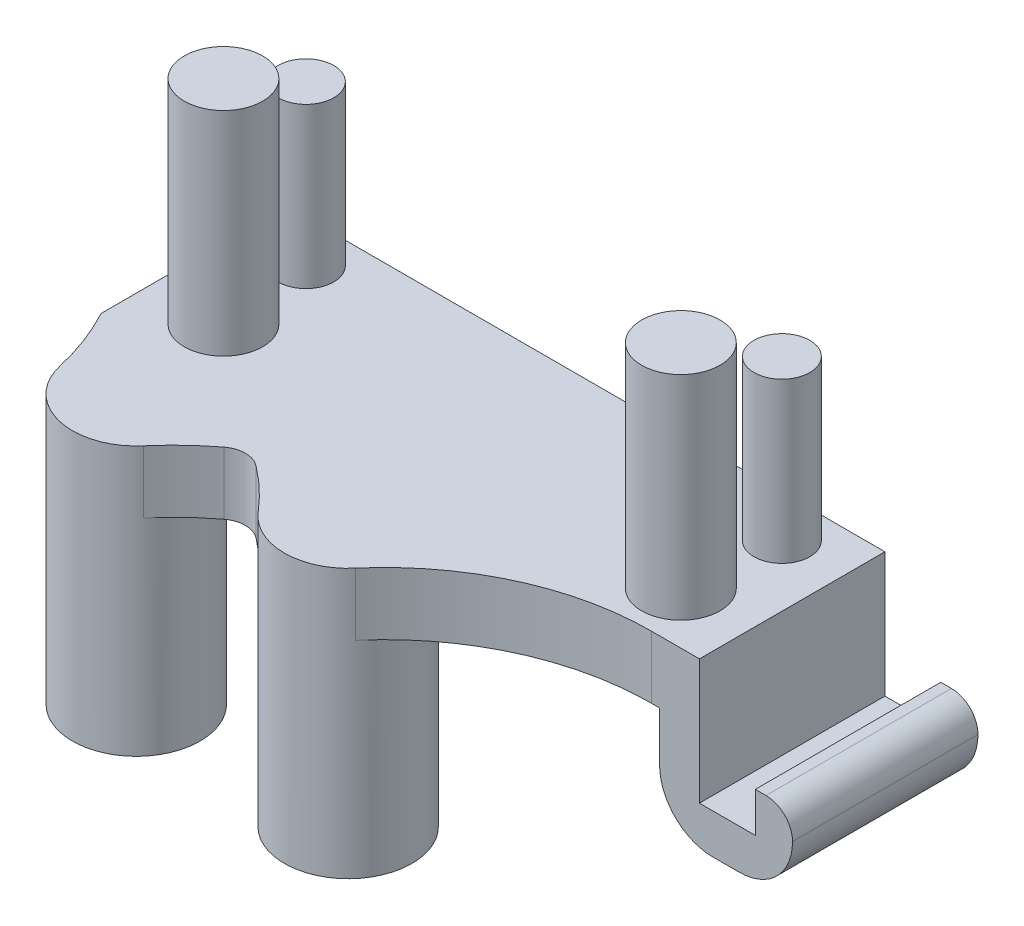
ISO-10303-21;
HEADER;
FILE_DESCRIPTION(('STEP AP214'),'2;1');
FILE_NAME('part.step','',(''),(''),'','','');
FILE_SCHEMA(('AUTOMOTIVE_DESIGN { 1 0 10303 214 1 1 1 1 }'));
ENDSEC;
DATA;
#1=APPLICATION_CONTEXT('core data for automotive mechanical design processes');
#2=APPLICATION_PROTOCOL_DEFINITION('international standard','automotive_design',2000,#1);
#3=PRODUCT_CONTEXT('',#1,'mechanical');
#4=PRODUCT('Part','Part','',(#3));
#5=PRODUCT_RELATED_PRODUCT_CATEGORY('part','',(#4));
#6=PRODUCT_DEFINITION_FORMATION('','',#4);
#7=PRODUCT_DEFINITION_CONTEXT('part definition',#1,'design');
#8=PRODUCT_DEFINITION('design','',#6,#7);
#9=PRODUCT_DEFINITION_SHAPE('','',#8);
#10=(LENGTH_UNIT() NAMED_UNIT(*) SI_UNIT(.MILLI.,.METRE.));
#11=(NAMED_UNIT(*) PLANE_ANGLE_UNIT() SI_UNIT($,.RADIAN.));
#12=(NAMED_UNIT(*) SI_UNIT($,.STERADIAN.) SOLID_ANGLE_UNIT());
#13=UNCERTAINTY_MEASURE_WITH_UNIT(LENGTH_MEASURE(1.E-05),#10,'distance_accuracy_value','');
#14=(GEOMETRIC_REPRESENTATION_CONTEXT(3) GLOBAL_UNCERTAINTY_ASSIGNED_CONTEXT((#13)) GLOBAL_UNIT_ASSIGNED_CONTEXT((#10,
#11,#12)) REPRESENTATION_CONTEXT('',''));
#15=CARTESIAN_POINT('',(0.,0.,0.));
#16=DIRECTION('',(0.,0.,1.));
#17=DIRECTION('',(1.,0.,0.));
#18=AXIS2_PLACEMENT_3D('',#15,#16,#17);
#19=CARTESIAN_POINT('',(-20.7000546697417,2.35,15.2497292150902));
#20=DIRECTION('',(0.,-1.,0.));
#21=DIRECTION('',(0.,0.,-1.));
#22=AXIS2_PLACEMENT_3D('',#19,#20,#21);
#23=CYLINDRICAL_SURFACE('',#22,1.);
#24=DIRECTION('',(0.,-1.,0.));
#25=VECTOR('',#24,1.);
#26=CARTESIAN_POINT('',(-20.0939153104234,2.35,14.4543707568557));
#27=LINE('',#26,#25);
#28=CARTESIAN_POINT('',(-20.0938195097702,2.35,14.454244757137));
#29=VERTEX_POINT('',#28);
#30=CARTESIAN_POINT('',(-20.0938195097698,0.,14.4542447571365));
#31=VERTEX_POINT('',#30);
#32=EDGE_CURVE('E340',#29,#31,#27,.T.);
#33=ORIENTED_EDGE('',*,*,#32,.F.);
#34=CARTESIAN_POINT('',(-20.7000546697417,2.35,15.2497292150902));
#35=DIRECTION('',(0.,1.,0.));
#36=DIRECTION('',(0.,0.,1.));
#37=AXIS2_PLACEMENT_3D('',#34,#35,#36);
#38=CIRCLE('',#37,1.);
#39=CARTESIAN_POINT('',(-21.3062898297128,2.35,14.4542447571376));
#40=VERTEX_POINT('',#39);
#41=EDGE_CURVE('E46',#29,#40,#38,.T.);
#42=ORIENTED_EDGE('',*,*,#41,.T.);
#43=DIRECTION('',(0.,-1.,0.));
#44=VECTOR('',#43,1.);
#45=CARTESIAN_POINT('',(-21.30619402906,0.,14.4543707568557));
#46=LINE('',#45,#44);
#47=CARTESIAN_POINT('',(-21.3062898297115,0.,14.4542447571393));
#48=VERTEX_POINT('',#47);
#49=EDGE_CURVE('E343',#48,#40,#46,.F.);
#50=ORIENTED_EDGE('',*,*,#49,.F.);
#51=CARTESIAN_POINT('',(-20.7000546697417,0.,15.2497292150902));
#52=DIRECTION('',(0.,1.,0.));
#53=DIRECTION('',(0.,0.,1.));
#54=AXIS2_PLACEMENT_3D('',#51,#52,#53);
#55=CIRCLE('',#54,1.);
#56=EDGE_CURVE('E12',#48,#31,#55,.F.);
#57=ORIENTED_EDGE('',*,*,#56,.T.);
#58=EDGE_LOOP('',(#33,#42,#50,#57));
#59=FACE_BOUND('',#58,.T.);
#60=ADVANCED_FACE('F39',(#59),#23,.F.);
#61=CARTESIAN_POINT('',(-2.96505466974173,-1.85,0.));
#62=DIRECTION('',(0.,0.,-1.));
#63=DIRECTION('',(-1.,0.,0.));
#64=AXIS2_PLACEMENT_3D('',#61,#62,#63);
#65=CYLINDRICAL_SURFACE('',#64,1.);
#66=DIRECTION('',(0.,0.,1.));
#67=VECTOR('',#66,1.);
#68=CARTESIAN_POINT('',(-1.96505466974173,-1.85,0.));
#69=LINE('',#68,#67);
#70=CARTESIAN_POINT('',(-1.96505466974173,-1.85,12.4079553392009));
#71=VERTEX_POINT('',#70);
#72=CARTESIAN_POINT('',(-1.96505466974173,-1.85,5.43295533920093));
#73=VERTEX_POINT('',#72);
#74=EDGE_CURVE('E274',#71,#73,#69,.F.);
#75=ORIENTED_EDGE('',*,*,#74,.T.);
#76=CARTESIAN_POINT('',(-2.96505466974173,-1.85,5.43295533920094));
#77=DIRECTION('',(0.,0.,1.));
#78=DIRECTION('',(1.,0.,0.));
#79=AXIS2_PLACEMENT_3D('',#76,#77,#78);
#80=CIRCLE('',#79,1.);
#81=CARTESIAN_POINT('',(-2.96505466974173,-0.85,5.43295533920093));
#82=VERTEX_POINT('',#81);
#83=EDGE_CURVE('E284',#82,#73,#80,.F.);
#84=ORIENTED_EDGE('',*,*,#83,.F.);
#85=DIRECTION('',(0.,0.,1.));
#86=VECTOR('',#85,1.);
#87=CARTESIAN_POINT('',(-2.96505466974173,-0.849999999999999,0.));
#88=LINE('',#87,#86);
#89=CARTESIAN_POINT('',(-2.96505466974173,-0.850000000000001,12.4079553392009));
#90=VERTEX_POINT('',#89);
#91=EDGE_CURVE('E282',#90,#82,#88,.F.);
#92=ORIENTED_EDGE('',*,*,#91,.F.);
#93=CARTESIAN_POINT('',(-2.96505466974173,-1.85,12.4079553392009));
#94=DIRECTION('',(0.,0.,-1.));
#95=DIRECTION('',(-1.,0.,0.));
#96=AXIS2_PLACEMENT_3D('',#93,#94,#95);
#97=CIRCLE('',#96,1.);
#98=EDGE_CURVE('E244',#71,#90,#97,.F.);
#99=ORIENTED_EDGE('',*,*,#98,.F.);
#100=EDGE_LOOP('',(#75,#84,#92,#99));
#101=FACE_BOUND('',#100,.T.);
#102=ADVANCED_FACE('F484',(#101),#65,.T.);
#103=CARTESIAN_POINT('',(-3.96505466974173,-1.85,0.));
#104=DIRECTION('',(0.,0.,1.));
#105=DIRECTION('',(1.,0.,0.));
#106=AXIS2_PLACEMENT_3D('',#103,#104,#105);
#107=CYLINDRICAL_SURFACE('',#106,2.);
#108=DIRECTION('',(0.,0.,1.));
#109=VECTOR('',#108,1.);
#110=CARTESIAN_POINT('',(-3.96505466974173,-3.85,0.));
#111=LINE('',#110,#109);
#112=CARTESIAN_POINT('',(-3.96505466974173,-3.85,5.43295533920094));
#113=VERTEX_POINT('',#112);
#114=CARTESIAN_POINT('',(-3.96505466974173,-3.85,12.4079553392009));
#115=VERTEX_POINT('',#114);
#116=EDGE_CURVE('E271',#113,#115,#111,.T.);
#117=ORIENTED_EDGE('',*,*,#116,.F.);
#118=CARTESIAN_POINT('',(-3.96505466974173,-1.85,5.43295533920094));
#119=DIRECTION('',(0.,0.,1.));
#120=DIRECTION('',(1.,0.,0.));
#121=AXIS2_PLACEMENT_3D('',#118,#119,#120);
#122=CIRCLE('',#121,2.);
#123=EDGE_CURVE('E277',#73,#113,#122,.F.);
#124=ORIENTED_EDGE('',*,*,#123,.F.);
#125=ORIENTED_EDGE('',*,*,#74,.F.);
#126=CARTESIAN_POINT('',(-3.96505466974173,-1.85,12.4079553392009));
#127=DIRECTION('',(0.,0.,-1.));
#128=DIRECTION('',(-1.,0.,0.));
#129=AXIS2_PLACEMENT_3D('',#126,#127,#128);
#130=CIRCLE('',#129,2.);
#131=EDGE_CURVE('E279',#115,#71,#130,.F.);
#132=ORIENTED_EDGE('',*,*,#131,.F.);
#133=EDGE_LOOP('',(#117,#124,#125,#132));
#134=FACE_BOUND('',#133,.T.);
#135=ADVANCED_FACE('F481',(#134),#107,.T.);
#136=CARTESIAN_POINT('',(-4.96505466974173,-1.85,5.43295533920094));
#137=DIRECTION('',(0.,0.,-1.));
#138=DIRECTION('',(-1.,0.,0.));
#139=AXIS2_PLACEMENT_3D('',#136,#137,#138);
#140=CYLINDRICAL_SURFACE('',#139,2.);
#141=DIRECTION('',(0.,0.,1.));
#142=VECTOR('',#141,1.);
#143=CARTESIAN_POINT('',(-6.96505466974173,-1.85,5.43295533920094));
#144=LINE('',#143,#142);
#145=CARTESIAN_POINT('',(-6.96505466974173,-1.85,5.43295533920094));
#146=VERTEX_POINT('',#145);
#147=CARTESIAN_POINT('',(-6.96505466974173,-1.85,12.4079553392009));
#148=VERTEX_POINT('',#147);
#149=EDGE_CURVE('E260',#146,#148,#144,.T.);
#150=ORIENTED_EDGE('',*,*,#149,.F.);
#151=CARTESIAN_POINT('',(-4.96505466974173,-1.85,5.43295533920094));
#152=DIRECTION('',(0.,0.,1.));
#153=DIRECTION('',(1.,0.,0.));
#154=AXIS2_PLACEMENT_3D('',#151,#152,#153);
#155=CIRCLE('',#154,2.);
#156=CARTESIAN_POINT('',(-4.96505466974173,-3.85,5.43295533920094));
#157=VERTEX_POINT('',#156);
#158=EDGE_CURVE('E266',#157,#146,#155,.F.);
#159=ORIENTED_EDGE('',*,*,#158,.F.);
#160=DIRECTION('',(0.,0.,1.));
#161=VECTOR('',#160,1.);
#162=CARTESIAN_POINT('',(-4.96505466974173,-3.85,5.43295533920094));
#163=LINE('',#162,#161);
#164=CARTESIAN_POINT('',(-4.96505466974173,-3.85,12.4079553392009));
#165=VERTEX_POINT('',#164);
#166=EDGE_CURVE('E263',#165,#157,#163,.F.);
#167=ORIENTED_EDGE('',*,*,#166,.F.);
#168=CARTESIAN_POINT('',(-4.96505466974173,-1.85,12.4079553392009));
#169=DIRECTION('',(0.,0.,-1.));
#170=DIRECTION('',(-1.,0.,0.));
#171=AXIS2_PLACEMENT_3D('',#168,#169,#170);
#172=CIRCLE('',#171,2.);
#173=EDGE_CURVE('E268',#148,#165,#172,.F.);
#174=ORIENTED_EDGE('',*,*,#173,.F.);
#175=EDGE_LOOP('',(#150,#159,#167,#174));
#176=FACE_BOUND('',#175,.T.);
#177=ADVANCED_FACE('F478',(#176),#140,.T.);
#178=CARTESIAN_POINT('',(-27.9650546697417,2.35,12.4079553392009));
#179=DIRECTION('',(0.,0.,-1.));
#180=DIRECTION('',(-1.,0.,0.));
#181=AXIS2_PLACEMENT_3D('',#178,#179,#180);
#182=PLANE('',#181);
#183=DIRECTION('',(1.,0.,0.));
#184=VECTOR('',#183,1.);
#185=CARTESIAN_POINT('',(-27.9650546697417,2.35,12.4079553392009));
#186=LINE('',#185,#184);
#187=CARTESIAN_POINT('',(-7.27480043587706,2.35,12.4079553392009));
#188=VERTEX_POINT('',#187);
#189=CARTESIAN_POINT('',(-5.46505466974173,2.35,12.4079553392009));
#190=VERTEX_POINT('',#189);
#191=EDGE_CURVE('E240',#188,#190,#186,.T.);
#192=ORIENTED_EDGE('',*,*,#191,.F.);
#193=CARTESIAN_POINT('',(-7.27480043587705,-0.117499999999999,12.4079553392009));
#194=CARTESIAN_POINT('',(-7.27480043587705,0.744166666666666,12.4079553392009));
#195=CARTESIAN_POINT('',(-7.27480043587705,1.60583333333334,12.4079553392009));
#196=CARTESIAN_POINT('',(-7.27480043587705,2.4675,12.4079553392009));
#197=(BOUNDED_CURVE() B_SPLINE_CURVE(3,(#193,#194,#195,#196),.UNSPECIFIED.,.F.,
.F.) B_SPLINE_CURVE_WITH_KNOTS((4,4),(-0.0001175,0.0024675),
.UNSPECIFIED.) CURVE() GEOMETRIC_REPRESENTATION_ITEM() RATIONAL_B_SPLINE_CURVE((1.,1.,1.,1.)) REPRESENTATION_ITEM(''));
#198=CARTESIAN_POINT('',(-7.27480043587707,0.,12.4079553392009));
#199=VERTEX_POINT('',#198);
#200=EDGE_CURVE('E288',#188,#199,#197,.F.);
#201=ORIENTED_EDGE('',*,*,#200,.T.);
#202=DIRECTION('',(1.,0.,0.));
#203=VECTOR('',#202,1.);
#204=CARTESIAN_POINT('',(-27.9650546697417,0.,12.4079553392009));
#205=LINE('',#204,#203);
#206=CARTESIAN_POINT('',(-6.96505466974174,0.,12.4079553392009));
#207=VERTEX_POINT('',#206);
#208=EDGE_CURVE('E246',#199,#207,#205,.T.);
#209=ORIENTED_EDGE('',*,*,#208,.T.);
#210=DIRECTION('',(0.,1.,0.));
#211=VECTOR('',#210,1.);
#212=CARTESIAN_POINT('',(-6.96505466974173,-3.85,12.4079553392009));
#213=LINE('',#212,#211);
#214=EDGE_CURVE('E220',#148,#207,#213,.T.);
#215=ORIENTED_EDGE('',*,*,#214,.F.);
#216=ORIENTED_EDGE('',*,*,#173,.T.);
#217=DIRECTION('',(-1.,0.,0.));
#218=VECTOR('',#217,1.);
#219=CARTESIAN_POINT('',(-5.46505466974173,-3.85,12.4079553392009));
#220=LINE('',#219,#218);
#221=EDGE_CURVE('E211',#115,#165,#220,.T.);
#222=ORIENTED_EDGE('',*,*,#221,.F.);
#223=ORIENTED_EDGE('',*,*,#131,.T.);
#224=ORIENTED_EDGE('',*,*,#98,.T.);
#225=DIRECTION('',(-1.,0.,0.));
#226=VECTOR('',#225,1.);
#227=CARTESIAN_POINT('',(-1.96505466974173,-0.850000000000001,12.4079553392009));
#228=LINE('',#227,#226);
#229=CARTESIAN_POINT('',(-3.36505466974173,-0.850000000000001,12.4079553392009));
#230=VERTEX_POINT('',#229);
#231=EDGE_CURVE('E205',#90,#230,#228,.T.);
#232=ORIENTED_EDGE('',*,*,#231,.T.);
#233=DIRECTION('',(0.,1.,0.));
#234=VECTOR('',#233,1.);
#235=CARTESIAN_POINT('',(-3.36505466974173,-2.35,12.4079553392009));
#236=LINE('',#235,#234);
#237=CARTESIAN_POINT('',(-3.36505466974173,-2.35,12.4079553392009));
#238=VERTEX_POINT('',#237);
#239=EDGE_CURVE('E192',#238,#230,#236,.T.);
#240=ORIENTED_EDGE('',*,*,#239,.F.);
#241=DIRECTION('',(1.,0.,0.));
#242=VECTOR('',#241,1.);
#243=CARTESIAN_POINT('',(-5.46505466974173,-2.35,12.4079553392009));
#244=LINE('',#243,#242);
#245=CARTESIAN_POINT('',(-5.46505466974173,-2.35,12.4079553392009));
#246=VERTEX_POINT('',#245);
#247=EDGE_CURVE('E184',#246,#238,#244,.T.);
#248=ORIENTED_EDGE('',*,*,#247,.F.);
#249=DIRECTION('',(0.,-1.,0.));
#250=VECTOR('',#249,1.);
#251=CARTESIAN_POINT('',(-5.46505466974173,2.35,12.4079553392009));
#252=LINE('',#251,#250);
#253=EDGE_CURVE('E167',#190,#246,#252,.T.);
#254=ORIENTED_EDGE('',*,*,#253,.F.);
#255=EDGE_LOOP('',(#192,#201,#209,#215,#216,#222,#223,#224,#232,#240,#248,#254));
#256=FACE_BOUND('',#255,.T.);
#257=ADVANCED_FACE('F190',(#256),#182,.F.);
#258=CARTESIAN_POINT('',(-5.46505466974173,2.35,5.43295533920094));
#259=DIRECTION('',(-1.,0.,0.));
#260=DIRECTION('',(0.,0.,1.));
#261=AXIS2_PLACEMENT_3D('',#258,#259,#260);
#262=PLANE('',#261);
#263=ORIENTED_EDGE('',*,*,#253,.T.);
#264=DIRECTION('',(0.,0.,1.));
#265=VECTOR('',#264,1.);
#266=CARTESIAN_POINT('',(-5.46505466974173,-2.35,5.43295533920094));
#267=LINE('',#266,#265);
#268=CARTESIAN_POINT('',(-5.46505466974173,-2.35,5.43295533920094));
#269=VERTEX_POINT('',#268);
#270=EDGE_CURVE('E171',#269,#246,#267,.T.);
#271=ORIENTED_EDGE('',*,*,#270,.F.);
#272=DIRECTION('',(0.,-1.,0.));
#273=VECTOR('',#272,1.);
#274=CARTESIAN_POINT('',(-5.46505466974173,2.35,5.43295533920094));
#275=LINE('',#274,#273);
#276=CARTESIAN_POINT('',(-5.46505466974173,2.35,5.43295533920094));
#277=VERTEX_POINT('',#276);
#278=EDGE_CURVE('E178',#277,#269,#275,.T.);
#279=ORIENTED_EDGE('',*,*,#278,.F.);
#280=DIRECTION('',(0.,0.,-1.));
#281=VECTOR('',#280,1.);
#282=CARTESIAN_POINT('',(-5.46505466974173,2.35,5.43295533920094));
#283=LINE('',#282,#281);
#284=EDGE_CURVE('E173',#190,#277,#283,.T.);
#285=ORIENTED_EDGE('',*,*,#284,.F.);
#286=EDGE_LOOP('',(#263,#271,#279,#285));
#287=FACE_BOUND('',#286,.T.);
#288=ADVANCED_FACE('F169',(#287),#262,.F.);
#289=CARTESIAN_POINT('',(0.,0.,0.));
#290=DIRECTION('',(0.,1.,0.));
#291=DIRECTION('',(0.,0.,1.));
#292=AXIS2_PLACEMENT_3D('',#289,#290,#291);
#293=PLANE('',#292);
#294=ORIENTED_EDGE('',*,*,#56,.F.);
#295=CARTESIAN_POINT('',(-22.8579086889937,0.,15.924084371459));
#296=CARTESIAN_POINT('',(-19.8633201197639,0.,12.4079553392009));
#297=CARTESIAN_POINT('',(-15.244800435877,0.,12.4079553392009));
#298=(BOUNDED_CURVE() B_SPLINE_CURVE(2,(#295,#296,#297),.UNSPECIFIED.,.F.,
.F.) B_SPLINE_CURVE_WITH_KNOTS((3,3),(0.,1.),
.UNSPECIFIED.) CURVE() GEOMETRIC_REPRESENTATION_ITEM() RATIONAL_B_SPLINE_CURVE((1.,
0.90785106068512,1.)) REPRESENTATION_ITEM(''));
#299=CARTESIAN_POINT('',(-22.8579086889937,0.,15.924084371459));
#300=VERTEX_POINT('',#299);
#301=EDGE_CURVE('E327',#48,#300,#298,.F.);
#302=ORIENTED_EDGE('',*,*,#301,.T.);
#303=CARTESIAN_POINT('',(-24.6850546697417,0.,14.3679553392009));
#304=DIRECTION('',(0.,1.,0.));
#305=DIRECTION('',(0.,0.,1.));
#306=AXIS2_PLACEMENT_3D('',#303,#304,#305);
#307=CIRCLE('',#306,2.4);
#308=CARTESIAN_POINT('',(-27.0238325068261,0.,14.906581581379));
#309=VERTEX_POINT('',#308);
#310=EDGE_CURVE('E850',#300,#309,#307,.T.);
#311=ORIENTED_EDGE('',*,*,#310,.T.);
#312=CARTESIAN_POINT('',(-27.9650546697417,0.,12.4079553392009));
#313=CARTESIAN_POINT('',(-27.32615230471,0.,13.5938738303724));
#314=CARTESIAN_POINT('',(-27.0238325068261,0.,14.906581581379));
#315=(BOUNDED_CURVE() B_SPLINE_CURVE(2,(#312,#313,#314),.UNSPECIFIED.,.F.,
.F.) B_SPLINE_CURVE_WITH_KNOTS((3,3),(0.,1.),
.UNSPECIFIED.) CURVE() GEOMETRIC_REPRESENTATION_ITEM() RATIONAL_B_SPLINE_CURVE((1.,
0.991048646310986,1.)) REPRESENTATION_ITEM(''));
#316=CARTESIAN_POINT('',(-27.9650546697417,0.,12.4079553392009));
#317=VERTEX_POINT('',#316);
#318=EDGE_CURVE('E324',#309,#317,#315,.F.);
#319=ORIENTED_EDGE('',*,*,#318,.T.);
#320=DIRECTION('',(0.,0.,1.));
#321=VECTOR('',#320,1.);
#322=CARTESIAN_POINT('',(-27.9650546697417,0.,5.43295533920094));
#323=LINE('',#322,#321);
#324=CARTESIAN_POINT('',(-27.9650546697417,0.,5.43295533920094));
#325=VERTEX_POINT('',#324);
#326=EDGE_CURVE('E233',#325,#317,#323,.T.);
#327=ORIENTED_EDGE('',*,*,#326,.F.);
#328=DIRECTION('',(-1.,0.,0.));
#329=VECTOR('',#328,1.);
#330=CARTESIAN_POINT('',(-27.9650546697417,0.,5.43295533920094));
#331=LINE('',#330,#329);
#332=CARTESIAN_POINT('',(-6.96505466974173,0.,5.43295533920094));
#333=VERTEX_POINT('',#332);
#334=EDGE_CURVE('E249',#333,#325,#331,.T.);
#335=ORIENTED_EDGE('',*,*,#334,.F.);
#336=DIRECTION('',(0.,0.,-1.));
#337=VECTOR('',#336,1.);
#338=CARTESIAN_POINT('',(-6.96505466974173,0.,5.43295533920094));
#339=LINE('',#338,#337);
#340=EDGE_CURVE('E210',#207,#333,#339,.T.);
#341=ORIENTED_EDGE('',*,*,#340,.F.);
#342=ORIENTED_EDGE('',*,*,#208,.F.);
#343=CARTESIAN_POINT('',(-14.8879086889937,0.,15.924084371459));
#344=CARTESIAN_POINT('',(-11.8933201197639,0.,12.4079553392009));
#345=CARTESIAN_POINT('',(-7.27480043587705,0.,12.4079553392009));
#346=(BOUNDED_CURVE() B_SPLINE_CURVE(2,(#343,#344,#345),.UNSPECIFIED.,.F.,
.F.) B_SPLINE_CURVE_WITH_KNOTS((3,3),(0.,1.),
.UNSPECIFIED.) CURVE() GEOMETRIC_REPRESENTATION_ITEM() RATIONAL_B_SPLINE_CURVE((1.,
0.90785106068512,1.)) REPRESENTATION_ITEM(''));
#347=CARTESIAN_POINT('',(-14.8879086889937,0.,15.924084371459));
#348=VERTEX_POINT('',#347);
#349=EDGE_CURVE('E313',#199,#348,#346,.F.);
#350=ORIENTED_EDGE('',*,*,#349,.T.);
#351=CARTESIAN_POINT('',(-16.7150546697417,0.,14.3679553392009));
#352=DIRECTION('',(0.,1.,0.));
#353=DIRECTION('',(0.,0.,1.));
#354=AXIS2_PLACEMENT_3D('',#351,#352,#353);
#355=CIRCLE('',#354,2.4);
#356=CARTESIAN_POINT('',(-18.5422006504897,0.,15.924084371459));
#357=VERTEX_POINT('',#356);
#358=EDGE_CURVE('E839',#348,#357,#355,.T.);
#359=ORIENTED_EDGE('',*,*,#358,.T.);
#360=CARTESIAN_POINT('',(-26.1553089036064,0.,12.4079553392009));
#361=CARTESIAN_POINT('',(-21.5367892197196,0.,12.4079553392009));
#362=CARTESIAN_POINT('',(-18.5422006504897,0.,15.924084371459));
#363=(BOUNDED_CURVE() B_SPLINE_CURVE(2,(#360,#361,#362),.UNSPECIFIED.,.F.,
.F.) B_SPLINE_CURVE_WITH_KNOTS((3,3),(0.,1.),
.UNSPECIFIED.) CURVE() GEOMETRIC_REPRESENTATION_ITEM() RATIONAL_B_SPLINE_CURVE((1.,
0.90785106068512,1.)) REPRESENTATION_ITEM(''));
#364=EDGE_CURVE('E337',#357,#31,#363,.F.);
#365=ORIENTED_EDGE('',*,*,#364,.T.);
#366=EDGE_LOOP('',(#294,#302,#311,#319,#327,#335,#341,#342,#350,#359,#365));
#367=FACE_BOUND('',#366,.T.);
#368=ADVANCED_FACE('F361',(#367),#293,.F.);
#369=CARTESIAN_POINT('',(-27.9650546697417,2.35,5.43295533920094));
#370=DIRECTION('',(1.,0.,0.));
#371=DIRECTION('',(0.,0.,-1.));
#372=AXIS2_PLACEMENT_3D('',#369,#370,#371);
#373=PLANE('',#372);
#374=ORIENTED_EDGE('',*,*,#326,.T.);
#375=CARTESIAN_POINT('',(-27.9650546697417,2.4675,12.4079553392009));
#376=CARTESIAN_POINT('',(-27.9650546697417,1.60583333333333,12.4079553392009));
#377=CARTESIAN_POINT('',(-27.9650546697417,0.744166666666666,12.4079553392009));
#378=CARTESIAN_POINT('',(-27.9650546697417,-0.1175,12.4079553392009));
#379=(BOUNDED_CURVE() B_SPLINE_CURVE(3,(#375,#376,#377,#378),.UNSPECIFIED.,.F.,
.F.) B_SPLINE_CURVE_WITH_KNOTS((4,4),(-0.0001175,0.0024675),
.UNSPECIFIED.) CURVE() GEOMETRIC_REPRESENTATION_ITEM() RATIONAL_B_SPLINE_CURVE((1.,1.,1.,1.)) REPRESENTATION_ITEM(''));
#380=CARTESIAN_POINT('',(-27.9650546697417,2.35,12.4079553392009));
#381=VERTEX_POINT('',#380);
#382=EDGE_CURVE('E177',#381,#317,#379,.T.);
#383=ORIENTED_EDGE('',*,*,#382,.F.);
#384=DIRECTION('',(0.,0.,1.));
#385=VECTOR('',#384,1.);
#386=CARTESIAN_POINT('',(-27.9650546697417,2.35,5.43295533920094));
#387=LINE('',#386,#385);
#388=CARTESIAN_POINT('',(-27.9650546697417,2.35,5.43295533920094));
#389=VERTEX_POINT('',#388);
#390=EDGE_CURVE('E243',#389,#381,#387,.T.);
#391=ORIENTED_EDGE('',*,*,#390,.F.);
#392=DIRECTION('',(0.,-1.,0.));
#393=VECTOR('',#392,1.);
#394=CARTESIAN_POINT('',(-27.9650546697417,2.35,5.43295533920094));
#395=LINE('',#394,#393);
#396=EDGE_CURVE('E256',#389,#325,#395,.T.);
#397=ORIENTED_EDGE('',*,*,#396,.T.);
#398=EDGE_LOOP('',(#374,#383,#391,#397));
#399=FACE_BOUND('',#398,.T.);
#400=ADVANCED_FACE('F371',(#399),#373,.F.);
#401=CARTESIAN_POINT('',(-27.9650546697417,2.35,5.43295533920094));
#402=DIRECTION('',(0.,0.,1.));
#403=DIRECTION('',(1.,0.,0.));
#404=AXIS2_PLACEMENT_3D('',#401,#402,#403);
#405=PLANE('',#404);
#406=DIRECTION('',(-1.,0.,0.));
#407=VECTOR('',#406,1.);
#408=CARTESIAN_POINT('',(-1.96505466974173,-0.85,5.43295533920093));
#409=LINE('',#408,#407);
#410=CARTESIAN_POINT('',(-3.36505466974173,-0.85,5.43295533920094));
#411=VERTEX_POINT('',#410);
#412=EDGE_CURVE('E208',#82,#411,#409,.T.);
#413=ORIENTED_EDGE('',*,*,#412,.F.);
#414=ORIENTED_EDGE('',*,*,#83,.T.);
#415=ORIENTED_EDGE('',*,*,#123,.T.);
#416=DIRECTION('',(1.,0.,0.));
#417=VECTOR('',#416,1.);
#418=CARTESIAN_POINT('',(-5.46505466974173,-3.85,5.43295533920094));
#419=LINE('',#418,#417);
#420=EDGE_CURVE('E213',#157,#113,#419,.T.);
#421=ORIENTED_EDGE('',*,*,#420,.F.);
#422=ORIENTED_EDGE('',*,*,#158,.T.);
#423=DIRECTION('',(0.,1.,0.));
#424=VECTOR('',#423,1.);
#425=CARTESIAN_POINT('',(-6.96505466974173,-3.85,5.43295533920094));
#426=LINE('',#425,#424);
#427=EDGE_CURVE('E216',#146,#333,#426,.T.);
#428=ORIENTED_EDGE('',*,*,#427,.T.);
#429=ORIENTED_EDGE('',*,*,#334,.T.);
#430=ORIENTED_EDGE('',*,*,#396,.F.);
#431=DIRECTION('',(-1.,0.,0.));
#432=VECTOR('',#431,1.);
#433=CARTESIAN_POINT('',(-27.9650546697417,2.35,5.43295533920094));
#434=LINE('',#433,#432);
#435=EDGE_CURVE('E254',#277,#389,#434,.T.);
#436=ORIENTED_EDGE('',*,*,#435,.F.);
#437=ORIENTED_EDGE('',*,*,#278,.T.);
#438=DIRECTION('',(-1.,0.,0.));
#439=VECTOR('',#438,1.);
#440=CARTESIAN_POINT('',(-5.46505466974173,-2.35,5.43295533920094));
#441=LINE('',#440,#439);
#442=CARTESIAN_POINT('',(-3.36505466974173,-2.35,5.43295533920094));
#443=VERTEX_POINT('',#442);
#444=EDGE_CURVE('E187',#443,#269,#441,.T.);
#445=ORIENTED_EDGE('',*,*,#444,.F.);
#446=DIRECTION('',(0.,1.,0.));
#447=VECTOR('',#446,1.);
#448=CARTESIAN_POINT('',(-3.36505466974173,-2.35,5.43295533920094));
#449=LINE('',#448,#447);
#450=EDGE_CURVE('E202',#443,#411,#449,.T.);
#451=ORIENTED_EDGE('',*,*,#450,.T.);
#452=EDGE_LOOP('',(#413,#414,#415,#421,#422,#428,#429,#430,#436,#437,#445,#451));
#453=FACE_BOUND('',#452,.T.);
#454=ADVANCED_FACE('F375',(#453),#405,.F.);
#455=CARTESIAN_POINT('',(0.,2.35,0.));
#456=DIRECTION('',(0.,1.,0.));
#457=DIRECTION('',(0.,0.,1.));
#458=AXIS2_PLACEMENT_3D('',#455,#456,#457);
#459=PLANE('',#458);
#460=ORIENTED_EDGE('',*,*,#41,.F.);
#461=CARTESIAN_POINT('',(-18.5422006504897,2.35,15.924084371459));
#462=CARTESIAN_POINT('',(-21.5367892197196,2.35,12.4079553392009));
#463=CARTESIAN_POINT('',(-26.1553089036064,2.35,12.4079553392009));
#464=(BOUNDED_CURVE() B_SPLINE_CURVE(2,(#461,#462,#463),.UNSPECIFIED.,.F.,
.F.) B_SPLINE_CURVE_WITH_KNOTS((3,3),(0.,1.),
.UNSPECIFIED.) CURVE() GEOMETRIC_REPRESENTATION_ITEM() RATIONAL_B_SPLINE_CURVE((1.,
0.90785106068512,1.)) REPRESENTATION_ITEM(''));
#465=CARTESIAN_POINT('',(-18.5422006504897,2.35,15.924084371459));
#466=VERTEX_POINT('',#465);
#467=EDGE_CURVE('E335',#29,#466,#464,.F.);
#468=ORIENTED_EDGE('',*,*,#467,.T.);
#469=CARTESIAN_POINT('',(-16.7150546697417,2.35,14.3679553392009));
#470=DIRECTION('',(0.,-1.,0.));
#471=DIRECTION('',(0.,0.,-1.));
#472=AXIS2_PLACEMENT_3D('',#469,#470,#471);
#473=CIRCLE('',#472,2.4);
#474=CARTESIAN_POINT('',(-14.8879086889937,2.35,15.924084371459));
#475=VERTEX_POINT('',#474);
#476=EDGE_CURVE('E847',#475,#466,#473,.T.);
#477=ORIENTED_EDGE('',*,*,#476,.F.);
#478=CARTESIAN_POINT('',(-7.27480043587705,2.35,12.4079553392009));
#479=CARTESIAN_POINT('',(-11.8933201197639,2.35,12.4079553392009));
#480=CARTESIAN_POINT('',(-14.8879086889937,2.35,15.924084371459));
#481=(BOUNDED_CURVE() B_SPLINE_CURVE(2,(#478,#479,#480),.UNSPECIFIED.,.F.,
.F.) B_SPLINE_CURVE_WITH_KNOTS((3,3),(0.,1.),
.UNSPECIFIED.) CURVE() GEOMETRIC_REPRESENTATION_ITEM() RATIONAL_B_SPLINE_CURVE((1.,
0.90785106068512,1.)) REPRESENTATION_ITEM(''));
#482=EDGE_CURVE('E318',#475,#188,#481,.F.);
#483=ORIENTED_EDGE('',*,*,#482,.T.);
#484=ORIENTED_EDGE('',*,*,#191,.T.);
#485=ORIENTED_EDGE('',*,*,#284,.T.);
#486=ORIENTED_EDGE('',*,*,#435,.T.);
#487=ORIENTED_EDGE('',*,*,#390,.T.);
#488=CARTESIAN_POINT('',(-27.0238325068261,2.35,14.906581581379));
#489=CARTESIAN_POINT('',(-27.32615230471,2.35,13.5938738303724));
#490=CARTESIAN_POINT('',(-27.9650546697417,2.35,12.4079553392009));
#491=(BOUNDED_CURVE() B_SPLINE_CURVE(2,(#488,#489,#490),.UNSPECIFIED.,.F.,
.F.) B_SPLINE_CURVE_WITH_KNOTS((3,3),(0.,1.),
.UNSPECIFIED.) CURVE() GEOMETRIC_REPRESENTATION_ITEM() RATIONAL_B_SPLINE_CURVE((1.,
0.991048646310987,1.)) REPRESENTATION_ITEM(''));
#492=CARTESIAN_POINT('',(-27.0238325068261,2.35,14.906581581379));
#493=VERTEX_POINT('',#492);
#494=EDGE_CURVE('E320',#381,#493,#491,.F.);
#495=ORIENTED_EDGE('',*,*,#494,.T.);
#496=CARTESIAN_POINT('',(-24.6850546697417,2.35,14.3679553392009));
#497=DIRECTION('',(0.,-1.,0.));
#498=DIRECTION('',(0.,0.,-1.));
#499=AXIS2_PLACEMENT_3D('',#496,#497,#498);
#500=CIRCLE('',#499,2.4);
#501=CARTESIAN_POINT('',(-22.8579086889937,2.35,15.924084371459));
#502=VERTEX_POINT('',#501);
#503=EDGE_CURVE('E853',#502,#493,#500,.T.);
#504=ORIENTED_EDGE('',*,*,#503,.F.);
#505=CARTESIAN_POINT('',(-15.244800435877,2.35,12.4079553392009));
#506=CARTESIAN_POINT('',(-19.8633201197639,2.35,12.4079553392009));
#507=CARTESIAN_POINT('',(-22.8579086889937,2.35,15.924084371459));
#508=(BOUNDED_CURVE() B_SPLINE_CURVE(2,(#505,#506,#507),.UNSPECIFIED.,.F.,
.F.) B_SPLINE_CURVE_WITH_KNOTS((3,3),(0.,1.),
.UNSPECIFIED.) CURVE() GEOMETRIC_REPRESENTATION_ITEM() RATIONAL_B_SPLINE_CURVE((1.,
0.90785106068512,1.)) REPRESENTATION_ITEM(''));
#509=EDGE_CURVE('E331',#502,#40,#508,.F.);
#510=ORIENTED_EDGE('',*,*,#509,.T.);
#511=EDGE_LOOP('',(#460,#468,#477,#483,#484,#485,#486,#487,#495,#504,#510));
#512=FACE_BOUND('',#511,.T.);
#513=CARTESIAN_POINT('',(-25.6650546697417,2.35,7.00795533920093));
#514=DIRECTION('',(0.,1.,0.));
#515=DIRECTION('',(0.,0.,1.));
#516=AXIS2_PLACEMENT_3D('',#513,#514,#515);
#517=CIRCLE('',#516,1.05);
#518=CARTESIAN_POINT('',(-25.6650546697417,2.35,8.05795533920093));
#519=VERTEX_POINT('',#518);
#520=EDGE_CURVE('E846',#519,#519,#517,.T.);
#521=ORIENTED_EDGE('',*,*,#520,.F.);
#522=EDGE_LOOP('',(#521));
#523=FACE_BOUND('',#522,.T.);
#524=CARTESIAN_POINT('',(-7.76505466974173,2.35,7.00795533920093));
#525=DIRECTION('',(0.,1.,0.));
#526=DIRECTION('',(0.,0.,1.));
#527=AXIS2_PLACEMENT_3D('',#524,#525,#526);
#528=CIRCLE('',#527,1.05);
#529=CARTESIAN_POINT('',(-7.76505466974173,2.35,8.05795533920094));
#530=VERTEX_POINT('',#529);
#531=EDGE_CURVE('E958',#530,#530,#528,.T.);
#532=ORIENTED_EDGE('',*,*,#531,.F.);
#533=EDGE_LOOP('',(#532));
#534=FACE_BOUND('',#533,.T.);
#535=CARTESIAN_POINT('',(-8.11505466974173,2.35,10.4579553392009));
#536=DIRECTION('',(0.,1.,0.));
#537=DIRECTION('',(0.,0.,1.));
#538=AXIS2_PLACEMENT_3D('',#535,#536,#537);
#539=CIRCLE('',#538,1.475);
#540=CARTESIAN_POINT('',(-8.11505466974173,2.35,11.9329553392009));
#541=VERTEX_POINT('',#540);
#542=EDGE_CURVE('E223',#541,#541,#539,.T.);
#543=ORIENTED_EDGE('',*,*,#542,.F.);
#544=EDGE_LOOP('',(#543));
#545=FACE_BOUND('',#544,.T.);
#546=CARTESIAN_POINT('',(-25.3150546697417,2.35,10.4579553392009));
#547=DIRECTION('',(0.,1.,0.));
#548=DIRECTION('',(0.,0.,1.));
#549=AXIS2_PLACEMENT_3D('',#546,#547,#548);
#550=CIRCLE('',#549,1.475);
#551=CARTESIAN_POINT('',(-25.3150546697417,2.35,11.9329553392009));
#552=VERTEX_POINT('',#551);
#553=EDGE_CURVE('E227',#552,#552,#550,.T.);
#554=ORIENTED_EDGE('',*,*,#553,.F.);
#555=EDGE_LOOP('',(#554));
#556=FACE_BOUND('',#555,.T.);
#557=ADVANCED_FACE('F372',(#512,#523,#534,#545,#556),#459,.T.);
#558=CARTESIAN_POINT('',(-25.3150546697417,10.35,10.4579553392009));
#559=DIRECTION('',(0.,-1.,0.));
#560=DIRECTION('',(0.,0.,-1.));
#561=AXIS2_PLACEMENT_3D('',#558,#559,#560);
#562=CYLINDRICAL_SURFACE('',#561,1.475);
#563=CARTESIAN_POINT('',(-25.3150546697417,10.35,10.4579553392009));
#564=DIRECTION('',(0.,1.,0.));
#565=DIRECTION('',(0.,0.,1.));
#566=AXIS2_PLACEMENT_3D('',#563,#564,#565);
#567=CIRCLE('',#566,1.475);
#568=CARTESIAN_POINT('',(-25.3150546697417,10.35,11.9329553392009));
#569=VERTEX_POINT('',#568);
#570=EDGE_CURVE('E230',#569,#569,#567,.T.);
#571=ORIENTED_EDGE('',*,*,#570,.F.);
#572=EDGE_LOOP('',(#571));
#573=FACE_BOUND('',#572,.T.);
#574=ORIENTED_EDGE('',*,*,#553,.T.);
#575=EDGE_LOOP('',(#574));
#576=FACE_BOUND('',#575,.T.);
#577=ADVANCED_FACE('F554',(#573,#576),#562,.T.);
#578=CARTESIAN_POINT('',(-25.3150546697417,10.35,10.4579553392009));
#579=DIRECTION('',(0.,1.,0.));
#580=DIRECTION('',(0.,0.,1.));
#581=AXIS2_PLACEMENT_3D('',#578,#579,#580);
#582=PLANE('',#581);
#583=ORIENTED_EDGE('',*,*,#570,.T.);
#584=EDGE_LOOP('',(#583));
#585=FACE_BOUND('',#584,.T.);
#586=ADVANCED_FACE('F551',(#585),#582,.T.);
#587=CARTESIAN_POINT('',(-8.11505466974173,10.35,10.4579553392009));
#588=DIRECTION('',(0.,-1.,0.));
#589=DIRECTION('',(0.,0.,-1.));
#590=AXIS2_PLACEMENT_3D('',#587,#588,#589);
#591=CYLINDRICAL_SURFACE('',#590,1.475);
#592=CARTESIAN_POINT('',(-8.11505466974173,10.35,10.4579553392009));
#593=DIRECTION('',(0.,1.,0.));
#594=DIRECTION('',(0.,0.,1.));
#595=AXIS2_PLACEMENT_3D('',#592,#593,#594);
#596=CIRCLE('',#595,1.475);
#597=CARTESIAN_POINT('',(-8.11505466974173,10.35,11.9329553392009));
#598=VERTEX_POINT('',#597);
#599=EDGE_CURVE('E224',#598,#598,#596,.T.);
#600=ORIENTED_EDGE('',*,*,#599,.F.);
#601=EDGE_LOOP('',(#600));
#602=FACE_BOUND('',#601,.T.);
#603=ORIENTED_EDGE('',*,*,#542,.T.);
#604=EDGE_LOOP('',(#603));
#605=FACE_BOUND('',#604,.T.);
#606=ADVANCED_FACE('F547',(#602,#605),#591,.T.);
#607=CARTESIAN_POINT('',(-8.11505466974173,10.35,10.4579553392009));
#608=DIRECTION('',(0.,1.,0.));
#609=DIRECTION('',(0.,0.,1.));
#610=AXIS2_PLACEMENT_3D('',#607,#608,#609);
#611=PLANE('',#610);
#612=ORIENTED_EDGE('',*,*,#599,.T.);
#613=EDGE_LOOP('',(#612));
#614=FACE_BOUND('',#613,.T.);
#615=ADVANCED_FACE('F544',(#614),#611,.T.);
#616=CARTESIAN_POINT('',(-6.96505466974173,-3.85,5.43295533920094));
#617=DIRECTION('',(1.,0.,0.));
#618=DIRECTION('',(0.,0.,-1.));
#619=AXIS2_PLACEMENT_3D('',#616,#617,#618);
#620=PLANE('',#619);
#621=ORIENTED_EDGE('',*,*,#427,.F.);
#622=ORIENTED_EDGE('',*,*,#149,.T.);
#623=ORIENTED_EDGE('',*,*,#214,.T.);
#624=ORIENTED_EDGE('',*,*,#340,.T.);
#625=EDGE_LOOP('',(#621,#622,#623,#624));
#626=FACE_BOUND('',#625,.T.);
#627=ADVANCED_FACE('F502',(#626),#620,.F.);
#628=CARTESIAN_POINT('',(0.,-3.85,0.));
#629=DIRECTION('',(0.,-1.,0.));
#630=DIRECTION('',(0.,0.,-1.));
#631=AXIS2_PLACEMENT_3D('',#628,#629,#630);
#632=PLANE('',#631);
#633=ORIENTED_EDGE('',*,*,#420,.T.);
#634=ORIENTED_EDGE('',*,*,#116,.T.);
#635=ORIENTED_EDGE('',*,*,#221,.T.);
#636=ORIENTED_EDGE('',*,*,#166,.T.);
#637=EDGE_LOOP('',(#633,#634,#635,#636));
#638=FACE_BOUND('',#637,.T.);
#639=ADVANCED_FACE('F496',(#638),#632,.T.);
#640=CARTESIAN_POINT('',(-1.96505466974173,-0.85,5.43295533920093));
#641=DIRECTION('',(0.,-1.,0.));
#642=DIRECTION('',(0.,0.,-1.));
#643=AXIS2_PLACEMENT_3D('',#640,#641,#642);
#644=PLANE('',#643);
#645=ORIENTED_EDGE('',*,*,#231,.F.);
#646=ORIENTED_EDGE('',*,*,#91,.T.);
#647=ORIENTED_EDGE('',*,*,#412,.T.);
#648=DIRECTION('',(0.,0.,-1.));
#649=VECTOR('',#648,1.);
#650=CARTESIAN_POINT('',(-3.36505466974173,-0.85,5.43295533920094));
#651=LINE('',#650,#649);
#652=EDGE_CURVE('E188',#230,#411,#651,.T.);
#653=ORIENTED_EDGE('',*,*,#652,.F.);
#654=EDGE_LOOP('',(#645,#646,#647,#653));
#655=FACE_BOUND('',#654,.T.);
#656=ADVANCED_FACE('F529',(#655),#644,.F.);
#657=CARTESIAN_POINT('',(-3.36505466974173,-2.35,5.43295533920094));
#658=DIRECTION('',(1.,0.,0.));
#659=DIRECTION('',(0.,0.,-1.));
#660=AXIS2_PLACEMENT_3D('',#657,#658,#659);
#661=PLANE('',#660);
#662=ORIENTED_EDGE('',*,*,#652,.T.);
#663=ORIENTED_EDGE('',*,*,#450,.F.);
#664=DIRECTION('',(0.,0.,-1.));
#665=VECTOR('',#664,1.);
#666=CARTESIAN_POINT('',(-3.36505466974173,-2.35,5.43295533920094));
#667=LINE('',#666,#665);
#668=EDGE_CURVE('E193',#238,#443,#667,.T.);
#669=ORIENTED_EDGE('',*,*,#668,.F.);
#670=ORIENTED_EDGE('',*,*,#239,.T.);
#671=EDGE_LOOP('',(#662,#663,#669,#670));
#672=FACE_BOUND('',#671,.T.);
#673=ADVANCED_FACE('F525',(#672),#661,.F.);
#674=CARTESIAN_POINT('',(0.,-2.35,0.));
#675=DIRECTION('',(0.,1.,0.));
#676=DIRECTION('',(0.,0.,1.));
#677=AXIS2_PLACEMENT_3D('',#674,#675,#676);
#678=PLANE('',#677);
#679=ORIENTED_EDGE('',*,*,#270,.T.);
#680=ORIENTED_EDGE('',*,*,#247,.T.);
#681=ORIENTED_EDGE('',*,*,#668,.T.);
#682=ORIENTED_EDGE('',*,*,#444,.T.);
#683=EDGE_LOOP('',(#679,#680,#681,#682));
#684=FACE_BOUND('',#683,.T.);
#685=ADVANCED_FACE('F182',(#684),#678,.T.);
#686=CARTESIAN_POINT('',(-7.76505466974173,8.35,7.00795533920093));
#687=DIRECTION('',(0.,-1.,0.));
#688=DIRECTION('',(0.,0.,-1.));
#689=AXIS2_PLACEMENT_3D('',#686,#687,#688);
#690=CYLINDRICAL_SURFACE('',#689,1.05);
#691=CARTESIAN_POINT('',(-7.76505466974173,8.35,7.00795533920093));
#692=DIRECTION('',(0.,1.,0.));
#693=DIRECTION('',(0.,0.,1.));
#694=AXIS2_PLACEMENT_3D('',#691,#692,#693);
#695=CIRCLE('',#694,1.05);
#696=CARTESIAN_POINT('',(-7.76505466974173,8.35,8.05795533920094));
#697=VERTEX_POINT('',#696);
#698=EDGE_CURVE('E201',#697,#697,#695,.T.);
#699=ORIENTED_EDGE('',*,*,#698,.F.);
#700=EDGE_LOOP('',(#699));
#701=FACE_BOUND('',#700,.T.);
#702=ORIENTED_EDGE('',*,*,#531,.T.);
#703=EDGE_LOOP('',(#702));
#704=FACE_BOUND('',#703,.T.);
#705=ADVANCED_FACE('F653',(#701,#704),#690,.T.);
#706=CARTESIAN_POINT('',(-7.76505466974173,8.35,7.00795533920093));
#707=DIRECTION('',(0.,1.,0.));
#708=DIRECTION('',(0.,0.,1.));
#709=AXIS2_PLACEMENT_3D('',#706,#707,#708);
#710=PLANE('',#709);
#711=ORIENTED_EDGE('',*,*,#698,.T.);
#712=EDGE_LOOP('',(#711));
#713=FACE_BOUND('',#712,.T.);
#714=ADVANCED_FACE('F643',(#713),#710,.T.);
#715=CARTESIAN_POINT('',(-25.6650546697417,8.35,7.00795533920093));
#716=DIRECTION('',(0.,-1.,0.));
#717=DIRECTION('',(0.,0.,-1.));
#718=AXIS2_PLACEMENT_3D('',#715,#716,#717);
#719=CYLINDRICAL_SURFACE('',#718,1.05);
#720=CARTESIAN_POINT('',(-25.6650546697417,8.35,7.00795533920093));
#721=DIRECTION('',(0.,1.,0.));
#722=DIRECTION('',(0.,0.,1.));
#723=AXIS2_PLACEMENT_3D('',#720,#721,#722);
#724=CIRCLE('',#723,1.05);
#725=CARTESIAN_POINT('',(-25.6650546697417,8.35,8.05795533920093));
#726=VERTEX_POINT('',#725);
#727=EDGE_CURVE('E885',#726,#726,#724,.T.);
#728=ORIENTED_EDGE('',*,*,#727,.F.);
#729=EDGE_LOOP('',(#728));
#730=FACE_BOUND('',#729,.T.);
#731=ORIENTED_EDGE('',*,*,#520,.T.);
#732=EDGE_LOOP('',(#731));
#733=FACE_BOUND('',#732,.T.);
#734=ADVANCED_FACE('F632',(#730,#733),#719,.T.);
#735=CARTESIAN_POINT('',(-25.6650546697417,8.35,7.00795533920093));
#736=DIRECTION('',(0.,1.,0.));
#737=DIRECTION('',(0.,0.,1.));
#738=AXIS2_PLACEMENT_3D('',#735,#736,#737);
#739=PLANE('',#738);
#740=ORIENTED_EDGE('',*,*,#727,.T.);
#741=EDGE_LOOP('',(#740));
#742=FACE_BOUND('',#741,.T.);
#743=ADVANCED_FACE('F627',(#742),#739,.T.);
#744=CARTESIAN_POINT('',(-16.7150546697417,2.35,14.3679553392009));
#745=DIRECTION('',(0.,-1.,0.));
#746=DIRECTION('',(0.,0.,-1.));
#747=AXIS2_PLACEMENT_3D('',#744,#745,#746);
#748=CYLINDRICAL_SURFACE('',#747,2.4);
#749=CARTESIAN_POINT('',(-16.7150546697417,-7.76,14.3679553392009));
#750=DIRECTION('',(0.,-1.,0.));
#751=DIRECTION('',(0.,0.,-1.));
#752=AXIS2_PLACEMENT_3D('',#749,#750,#751);
#753=CIRCLE('',#752,2.4);
#754=CARTESIAN_POINT('',(-16.7150546697417,-7.76,11.9679553392009));
#755=VERTEX_POINT('',#754);
#756=EDGE_CURVE('E852',#755,#755,#753,.T.);
#757=ORIENTED_EDGE('',*,*,#756,.F.);
#758=EDGE_LOOP('',(#757));
#759=FACE_BOUND('',#758,.T.);
#760=ORIENTED_EDGE('',*,*,#358,.F.);
#761=CARTESIAN_POINT('',(-14.8879086889937,2.4675,15.924084371459));
#762=CARTESIAN_POINT('',(-14.8879086889937,1.60583333333333,15.924084371459));
#763=CARTESIAN_POINT('',(-14.8879086889937,0.744166666666666,15.924084371459));
#764=CARTESIAN_POINT('',(-14.8879086889937,-0.1175,15.924084371459));
#765=(BOUNDED_CURVE() B_SPLINE_CURVE(3,(#761,#762,#763,#764),.UNSPECIFIED.,.F.,
.F.) B_SPLINE_CURVE_WITH_KNOTS((4,4),(-0.0001175,0.0024675),
.UNSPECIFIED.) CURVE() GEOMETRIC_REPRESENTATION_ITEM() RATIONAL_B_SPLINE_CURVE((1.,1.,1.,1.)) REPRESENTATION_ITEM(''));
#766=EDGE_CURVE('E294',#348,#475,#765,.F.);
#767=ORIENTED_EDGE('',*,*,#766,.T.);
#768=ORIENTED_EDGE('',*,*,#476,.T.);
#769=CARTESIAN_POINT('',(-18.5422006504897,-0.1175,15.924084371459));
#770=CARTESIAN_POINT('',(-18.5422006504897,0.744166666666666,15.924084371459));
#771=CARTESIAN_POINT('',(-18.5422006504897,1.60583333333333,15.924084371459));
#772=CARTESIAN_POINT('',(-18.5422006504897,2.4675,15.924084371459));
#773=(BOUNDED_CURVE() B_SPLINE_CURVE(3,(#769,#770,#771,#772),.UNSPECIFIED.,.F.,
.F.) B_SPLINE_CURVE_WITH_KNOTS((4,4),(-0.0001175,0.0024675),
.UNSPECIFIED.) CURVE() GEOMETRIC_REPRESENTATION_ITEM() RATIONAL_B_SPLINE_CURVE((1.,1.,1.,1.)) REPRESENTATION_ITEM(''));
#774=EDGE_CURVE('E290',#466,#357,#773,.F.);
#775=ORIENTED_EDGE('',*,*,#774,.T.);
#776=EDGE_LOOP('',(#760,#767,#768,#775));
#777=FACE_BOUND('',#776,.T.);
#778=ADVANCED_FACE('F619',(#759,#777),#748,.T.);
#779=CARTESIAN_POINT('',(-16.7150546697417,-7.76,14.3679553392009));
#780=DIRECTION('',(0.,-1.,0.));
#781=DIRECTION('',(0.,0.,-1.));
#782=AXIS2_PLACEMENT_3D('',#779,#780,#781);
#783=PLANE('',#782);
#784=ORIENTED_EDGE('',*,*,#756,.T.);
#785=EDGE_LOOP('',(#784));
#786=FACE_BOUND('',#785,.T.);
#787=ADVANCED_FACE('F614',(#786),#783,.T.);
#788=CARTESIAN_POINT('',(-24.6850546697417,2.35,14.3679553392009));
#789=DIRECTION('',(0.,-1.,0.));
#790=DIRECTION('',(0.,0.,-1.));
#791=AXIS2_PLACEMENT_3D('',#788,#789,#790);
#792=CYLINDRICAL_SURFACE('',#791,2.4);
#793=CARTESIAN_POINT('',(-24.6850546697417,-7.76,14.3679553392009));
#794=DIRECTION('',(0.,-1.,0.));
#795=DIRECTION('',(0.,0.,-1.));
#796=AXIS2_PLACEMENT_3D('',#793,#794,#795);
#797=CIRCLE('',#796,2.4);
#798=CARTESIAN_POINT('',(-24.6850546697417,-7.76,11.9679553392009));
#799=VERTEX_POINT('',#798);
#800=EDGE_CURVE('E872',#799,#799,#797,.T.);
#801=ORIENTED_EDGE('',*,*,#800,.F.);
#802=EDGE_LOOP('',(#801));
#803=FACE_BOUND('',#802,.T.);
#804=ORIENTED_EDGE('',*,*,#503,.T.);
#805=CARTESIAN_POINT('',(-27.0238325068261,-0.1175,14.906581581379));
#806=CARTESIAN_POINT('',(-27.0238325068261,0.744166666666666,14.906581581379));
#807=CARTESIAN_POINT('',(-27.0238325068261,1.60583333333333,14.906581581379));
#808=CARTESIAN_POINT('',(-27.0238325068261,2.4675,14.906581581379));
#809=(BOUNDED_CURVE() B_SPLINE_CURVE(3,(#805,#806,#807,#808),.UNSPECIFIED.,.F.,
.F.) B_SPLINE_CURVE_WITH_KNOTS((4,4),(-0.0001175,0.0024675),
.UNSPECIFIED.) CURVE() GEOMETRIC_REPRESENTATION_ITEM() RATIONAL_B_SPLINE_CURVE((1.,1.,1.,1.)) REPRESENTATION_ITEM(''));
#810=EDGE_CURVE('E305',#493,#309,#809,.F.);
#811=ORIENTED_EDGE('',*,*,#810,.T.);
#812=ORIENTED_EDGE('',*,*,#310,.F.);
#813=CARTESIAN_POINT('',(-22.8579086889937,2.4675,15.924084371459));
#814=CARTESIAN_POINT('',(-22.8579086889937,1.60583333333333,15.924084371459));
#815=CARTESIAN_POINT('',(-22.8579086889937,0.744166666666666,15.924084371459));
#816=CARTESIAN_POINT('',(-22.8579086889937,-0.1175,15.924084371459));
#817=(BOUNDED_CURVE() B_SPLINE_CURVE(3,(#813,#814,#815,#816),.UNSPECIFIED.,.F.,
.F.) B_SPLINE_CURVE_WITH_KNOTS((4,4),(-0.0001175,0.0024675),
.UNSPECIFIED.) CURVE() GEOMETRIC_REPRESENTATION_ITEM() RATIONAL_B_SPLINE_CURVE((1.,1.,1.,1.)) REPRESENTATION_ITEM(''));
#818=EDGE_CURVE('E300',#300,#502,#817,.F.);
#819=ORIENTED_EDGE('',*,*,#818,.T.);
#820=EDGE_LOOP('',(#804,#811,#812,#819));
#821=FACE_BOUND('',#820,.T.);
#822=ADVANCED_FACE('F605',(#803,#821),#792,.T.);
#823=CARTESIAN_POINT('',(-24.6850546697417,-7.76,14.3679553392009));
#824=DIRECTION('',(0.,-1.,0.));
#825=DIRECTION('',(0.,0.,-1.));
#826=AXIS2_PLACEMENT_3D('',#823,#824,#825);
#827=PLANE('',#826);
#828=ORIENTED_EDGE('',*,*,#800,.T.);
#829=EDGE_LOOP('',(#828));
#830=FACE_BOUND('',#829,.T.);
#831=ADVANCED_FACE('F601',(#830),#827,.T.);
#832=CARTESIAN_POINT('',(-7.27480043587705,2.4675,12.4079553392009));
#833=CARTESIAN_POINT('',(-7.27480043587705,1.60583333333334,12.4079553392009));
#834=CARTESIAN_POINT('',(-7.27480043587705,0.744166666666666,12.4079553392009));
#835=CARTESIAN_POINT('',(-7.27480043587705,-0.117499999999999,12.4079553392009));
#836=CARTESIAN_POINT('',(-11.8933201197639,2.4675,12.4079553392009));
#837=CARTESIAN_POINT('',(-11.8933201197639,1.60583333333334,12.4079553392009));
#838=CARTESIAN_POINT('',(-11.8933201197639,0.744166666666666,12.4079553392009));
#839=CARTESIAN_POINT('',(-11.8933201197639,-0.117499999999999,12.4079553392009));
#840=CARTESIAN_POINT('',(-14.8879086889937,2.4675,15.924084371459));
#841=CARTESIAN_POINT('',(-14.8879086889937,1.60583333333333,15.924084371459));
#842=CARTESIAN_POINT('',(-14.8879086889937,0.744166666666666,15.924084371459));
#843=CARTESIAN_POINT('',(-14.8879086889937,-0.1175,15.924084371459));
#844=(BOUNDED_SURFACE() B_SPLINE_SURFACE(2,3,((#832,#833,#834,#835),(#836,#837,#838,#839),(#840,
#841,#842,#843)),.UNSPECIFIED.,.F.,.F.,.F.) B_SPLINE_SURFACE_WITH_KNOTS((3,3),(4,4),(0.,1.),
(-0.0001175,0.0024675),
.UNSPECIFIED.) GEOMETRIC_REPRESENTATION_ITEM() RATIONAL_B_SPLINE_SURFACE(((1.,1.,1.,1.),
(0.90785106068512,0.90785106068512,0.90785106068512,0.90785106068512),(1.,1.,1.,1.))) REPRESENTATION_ITEM('') SURFACE());
#845=ORIENTED_EDGE('',*,*,#482,.F.);
#846=ORIENTED_EDGE('',*,*,#766,.F.);
#847=ORIENTED_EDGE('',*,*,#349,.F.);
#848=ORIENTED_EDGE('',*,*,#200,.F.);
#849=EDGE_LOOP('',(#845,#846,#847,#848));
#850=FACE_BOUND('',#849,.T.);
#851=ADVANCED_FACE('F428',(#850),#844,.T.);
#852=CARTESIAN_POINT('',(-27.0238325068261,2.4675,14.906581581379));
#853=CARTESIAN_POINT('',(-27.0238325068261,1.60583333333333,14.906581581379));
#854=CARTESIAN_POINT('',(-27.0238325068261,0.744166666666666,14.906581581379));
#855=CARTESIAN_POINT('',(-27.0238325068261,-0.1175,14.906581581379));
#856=CARTESIAN_POINT('',(-27.32615230471,2.4675,13.5938738303724));
#857=CARTESIAN_POINT('',(-27.32615230471,1.60583333333333,13.5938738303724));
#858=CARTESIAN_POINT('',(-27.32615230471,0.744166666666666,13.5938738303724));
#859=CARTESIAN_POINT('',(-27.32615230471,-0.1175,13.5938738303724));
#860=CARTESIAN_POINT('',(-27.9650546697417,2.4675,12.4079553392009));
#861=CARTESIAN_POINT('',(-27.9650546697417,1.60583333333333,12.4079553392009));
#862=CARTESIAN_POINT('',(-27.9650546697417,0.744166666666666,12.4079553392009));
#863=CARTESIAN_POINT('',(-27.9650546697417,-0.1175,12.4079553392009));
#864=(BOUNDED_SURFACE() B_SPLINE_SURFACE(2,3,((#852,#853,#854,#855),(#856,#857,#858,#859),(#860,
#861,#862,#863)),.UNSPECIFIED.,.F.,.F.,.F.) B_SPLINE_SURFACE_WITH_KNOTS((3,3),(4,4),(0.,1.),
(-0.0001175,0.0024675),
.UNSPECIFIED.) GEOMETRIC_REPRESENTATION_ITEM() RATIONAL_B_SPLINE_SURFACE(((1.,1.,1.,1.),
(0.991048646310986,0.991048646310986,0.991048646310986,0.991048646310986),(1.,1.,1.,1.))) REPRESENTATION_ITEM('') SURFACE());
#865=ORIENTED_EDGE('',*,*,#318,.F.);
#866=ORIENTED_EDGE('',*,*,#810,.F.);
#867=ORIENTED_EDGE('',*,*,#494,.F.);
#868=ORIENTED_EDGE('',*,*,#382,.T.);
#869=EDGE_LOOP('',(#865,#866,#867,#868));
#870=FACE_BOUND('',#869,.T.);
#871=ADVANCED_FACE('F405',(#870),#864,.T.);
#872=CARTESIAN_POINT('',(-18.5422006504897,2.4675,15.924084371459));
#873=CARTESIAN_POINT('',(-18.5422006504897,1.60583333333333,15.924084371459));
#874=CARTESIAN_POINT('',(-18.5422006504897,0.744166666666666,15.924084371459));
#875=CARTESIAN_POINT('',(-18.5422006504897,-0.1175,15.924084371459));
#876=CARTESIAN_POINT('',(-21.5367892197196,2.4675,12.4079553392009));
#877=CARTESIAN_POINT('',(-21.5367892197196,1.60583333333334,12.4079553392009));
#878=CARTESIAN_POINT('',(-21.5367892197196,0.744166666666666,12.4079553392009));
#879=CARTESIAN_POINT('',(-21.5367892197196,-0.117499999999999,12.4079553392009));
#880=CARTESIAN_POINT('',(-26.1553089036064,2.4675,12.4079553392009));
#881=CARTESIAN_POINT('',(-26.1553089036064,1.60583333333334,12.4079553392009));
#882=CARTESIAN_POINT('',(-26.1553089036064,0.744166666666666,12.4079553392009));
#883=CARTESIAN_POINT('',(-26.1553089036064,-0.117499999999999,12.4079553392009));
#884=(BOUNDED_SURFACE() B_SPLINE_SURFACE(2,3,((#872,#873,#874,#875),(#876,#877,#878,#879),(#880,
#881,#882,#883)),.UNSPECIFIED.,.F.,.F.,.F.) B_SPLINE_SURFACE_WITH_KNOTS((3,3),(4,4),(0.,1.),
(-0.0001175,0.0024675),
.UNSPECIFIED.) GEOMETRIC_REPRESENTATION_ITEM() RATIONAL_B_SPLINE_SURFACE(((1.,1.,1.,1.),
(0.90785106068512,0.90785106068512,0.90785106068512,0.90785106068512),(1.,1.,1.,1.))) REPRESENTATION_ITEM('') SURFACE());
#885=ORIENTED_EDGE('',*,*,#467,.F.);
#886=ORIENTED_EDGE('',*,*,#32,.T.);
#887=ORIENTED_EDGE('',*,*,#364,.F.);
#888=ORIENTED_EDGE('',*,*,#774,.F.);
#889=EDGE_LOOP('',(#885,#886,#887,#888));
#890=FACE_BOUND('',#889,.T.);
#891=ADVANCED_FACE('F427',(#890),#884,.T.);
#892=CARTESIAN_POINT('',(-15.244800435877,2.4675,12.4079553392009));
#893=CARTESIAN_POINT('',(-15.244800435877,1.60583333333334,12.4079553392009));
#894=CARTESIAN_POINT('',(-15.244800435877,0.744166666666666,12.4079553392009));
#895=CARTESIAN_POINT('',(-15.244800435877,-0.117499999999999,12.4079553392009));
#896=CARTESIAN_POINT('',(-19.8633201197639,2.4675,12.4079553392009));
#897=CARTESIAN_POINT('',(-19.8633201197639,1.60583333333334,12.4079553392009));
#898=CARTESIAN_POINT('',(-19.8633201197639,0.744166666666666,12.4079553392009));
#899=CARTESIAN_POINT('',(-19.8633201197639,-0.117499999999999,12.4079553392009));
#900=CARTESIAN_POINT('',(-22.8579086889937,2.4675,15.924084371459));
#901=CARTESIAN_POINT('',(-22.8579086889937,1.60583333333333,15.924084371459));
#902=CARTESIAN_POINT('',(-22.8579086889937,0.744166666666666,15.924084371459));
#903=CARTESIAN_POINT('',(-22.8579086889937,-0.1175,15.924084371459));
#904=(BOUNDED_SURFACE() B_SPLINE_SURFACE(2,3,((#892,#893,#894,#895),(#896,#897,#898,#899),(#900,
#901,#902,#903)),.UNSPECIFIED.,.F.,.F.,.F.) B_SPLINE_SURFACE_WITH_KNOTS((3,3),(4,4),(0.,1.),
(-0.0001175,0.0024675),
.UNSPECIFIED.) GEOMETRIC_REPRESENTATION_ITEM() RATIONAL_B_SPLINE_SURFACE(((1.,1.,1.,1.),
(0.90785106068512,0.90785106068512,0.90785106068512,0.90785106068512),(1.,1.,1.,1.))) REPRESENTATION_ITEM('') SURFACE());
#905=ORIENTED_EDGE('',*,*,#301,.F.);
#906=ORIENTED_EDGE('',*,*,#49,.T.);
#907=ORIENTED_EDGE('',*,*,#509,.F.);
#908=ORIENTED_EDGE('',*,*,#818,.F.);
#909=EDGE_LOOP('',(#905,#906,#907,#908));
#910=FACE_BOUND('',#909,.T.);
#911=ADVANCED_FACE('F433',(#910),#904,.T.);
#912=CLOSED_SHELL('',(#60,#102,#135,#177,#257,#288,#368,#400,#454,#557,#577,#586,#606,#615,#627,
#639,#656,#673,#685,#705,#714,#734,#743,#778,#787,#822,#831,#851,#871,#891,#911));
#913=MANIFOLD_SOLID_BREP('B2',#912);
#914=ADVANCED_BREP_SHAPE_REPRESENTATION('',(#18,#913),#14);
#915=SHAPE_DEFINITION_REPRESENTATION(#9,#914);
ENDSEC;
END-ISO-10303-21;
